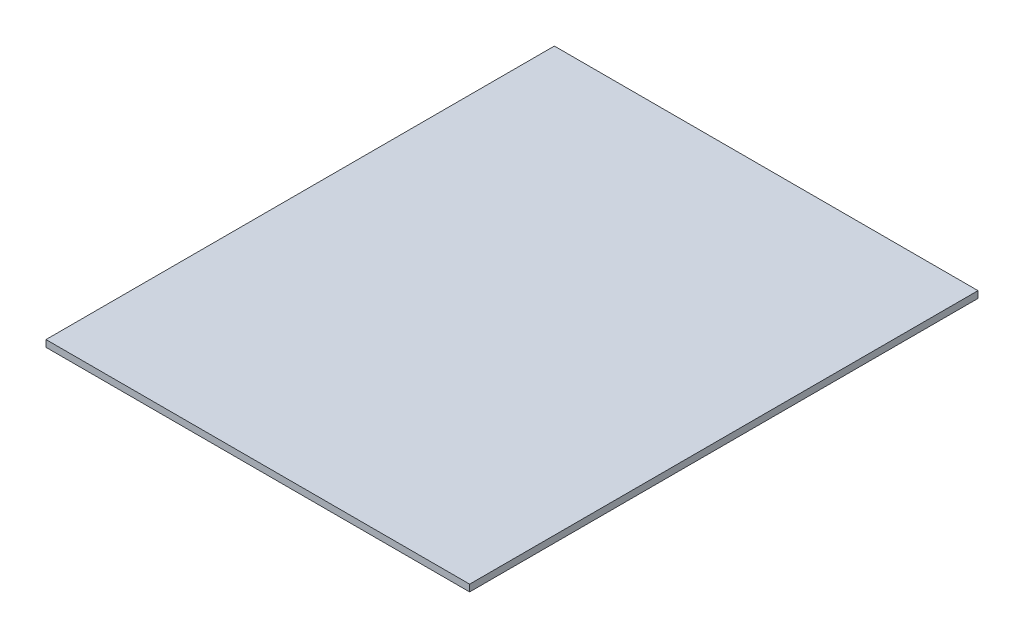
ISO-10303-21;
HEADER;
FILE_DESCRIPTION(('STEP AP214'),'2;1');
FILE_NAME('part.step','',(''),(''),'','','');
FILE_SCHEMA(('AUTOMOTIVE_DESIGN { 1 0 10303 214 1 1 1 1 }'));
ENDSEC;
DATA;
#1=APPLICATION_CONTEXT('core data for automotive mechanical design processes');
#2=APPLICATION_PROTOCOL_DEFINITION('international standard','automotive_design',2000,#1);
#3=PRODUCT_CONTEXT('',#1,'mechanical');
#4=PRODUCT('Part','Part','',(#3));
#5=PRODUCT_RELATED_PRODUCT_CATEGORY('part','',(#4));
#6=PRODUCT_DEFINITION_FORMATION('','',#4);
#7=PRODUCT_DEFINITION_CONTEXT('part definition',#1,'design');
#8=PRODUCT_DEFINITION('design','',#6,#7);
#9=PRODUCT_DEFINITION_SHAPE('','',#8);
#10=(LENGTH_UNIT() NAMED_UNIT(*) SI_UNIT(.MILLI.,.METRE.));
#11=(NAMED_UNIT(*) PLANE_ANGLE_UNIT() SI_UNIT($,.RADIAN.));
#12=(NAMED_UNIT(*) SI_UNIT($,.STERADIAN.) SOLID_ANGLE_UNIT());
#13=UNCERTAINTY_MEASURE_WITH_UNIT(LENGTH_MEASURE(1.E-05),#10,'distance_accuracy_value','');
#14=(GEOMETRIC_REPRESENTATION_CONTEXT(3) GLOBAL_UNCERTAINTY_ASSIGNED_CONTEXT((#13)) GLOBAL_UNIT_ASSIGNED_CONTEXT((#10,
#11,#12)) REPRESENTATION_CONTEXT('',''));
#15=CARTESIAN_POINT('',(0.,0.,0.));
#16=DIRECTION('',(0.,0.,1.));
#17=DIRECTION('',(1.,0.,0.));
#18=AXIS2_PLACEMENT_3D('',#15,#16,#17);
#19=CARTESIAN_POINT('',(158.75,5.08,190.5));
#20=DIRECTION('',(-1.,0.,0.));
#21=DIRECTION('',(0.,0.,1.));
#22=AXIS2_PLACEMENT_3D('',#19,#20,#21);
#23=PLANE('',#22);
#24=DIRECTION('',(0.,0.,-1.));
#25=VECTOR('',#24,1.);
#26=CARTESIAN_POINT('',(158.75,0.,190.5));
#27=LINE('',#26,#25);
#28=CARTESIAN_POINT('',(158.75,0.,190.5));
#29=VERTEX_POINT('',#28);
#30=CARTESIAN_POINT('',(158.75,0.,-190.5));
#31=VERTEX_POINT('',#30);
#32=EDGE_CURVE('E96',#29,#31,#27,.T.);
#33=ORIENTED_EDGE('',*,*,#32,.T.);
#34=DIRECTION('',(0.,-1.,0.));
#35=VECTOR('',#34,1.);
#36=CARTESIAN_POINT('',(158.75,5.08,-190.5));
#37=LINE('',#36,#35);
#38=CARTESIAN_POINT('',(158.75,5.08,-190.5));
#39=VERTEX_POINT('',#38);
#40=EDGE_CURVE('E11',#39,#31,#37,.T.);
#41=ORIENTED_EDGE('',*,*,#40,.F.);
#42=DIRECTION('',(0.,0.,-1.));
#43=VECTOR('',#42,1.);
#44=CARTESIAN_POINT('',(158.75,5.08,190.5));
#45=LINE('',#44,#43);
#46=CARTESIAN_POINT('',(158.75,5.08,190.5));
#47=VERTEX_POINT('',#46);
#48=EDGE_CURVE('E84',#47,#39,#45,.T.);
#49=ORIENTED_EDGE('',*,*,#48,.F.);
#50=DIRECTION('',(0.,-1.,0.));
#51=VECTOR('',#50,1.);
#52=CARTESIAN_POINT('',(158.75,5.08,190.5));
#53=LINE('',#52,#51);
#54=EDGE_CURVE('E92',#47,#29,#53,.T.);
#55=ORIENTED_EDGE('',*,*,#54,.T.);
#56=EDGE_LOOP('',(#33,#41,#49,#55));
#57=FACE_BOUND('',#56,.T.);
#58=ADVANCED_FACE('F33',(#57),#23,.F.);
#59=CARTESIAN_POINT('',(-158.75,5.08,-190.5));
#60=DIRECTION('',(0.,0.,1.));
#61=DIRECTION('',(1.,0.,0.));
#62=AXIS2_PLACEMENT_3D('',#59,#60,#61);
#63=PLANE('',#62);
#64=DIRECTION('',(-1.,0.,0.));
#65=VECTOR('',#64,1.);
#66=CARTESIAN_POINT('',(-158.75,0.,-190.5));
#67=LINE('',#66,#65);
#68=CARTESIAN_POINT('',(-158.75,0.,-190.5));
#69=VERTEX_POINT('',#68);
#70=EDGE_CURVE('E88',#31,#69,#67,.T.);
#71=ORIENTED_EDGE('',*,*,#70,.T.);
#72=DIRECTION('',(0.,-1.,0.));
#73=VECTOR('',#72,1.);
#74=CARTESIAN_POINT('',(-158.75,5.08,-190.5));
#75=LINE('',#74,#73);
#76=CARTESIAN_POINT('',(-158.75,5.08,-190.5));
#77=VERTEX_POINT('',#76);
#78=EDGE_CURVE('E41',#77,#69,#75,.T.);
#79=ORIENTED_EDGE('',*,*,#78,.F.);
#80=DIRECTION('',(-1.,0.,0.));
#81=VECTOR('',#80,1.);
#82=CARTESIAN_POINT('',(-158.75,5.08,-190.5));
#83=LINE('',#82,#81);
#84=EDGE_CURVE('E79',#39,#77,#83,.T.);
#85=ORIENTED_EDGE('',*,*,#84,.F.);
#86=ORIENTED_EDGE('',*,*,#40,.T.);
#87=EDGE_LOOP('',(#71,#79,#85,#86));
#88=FACE_BOUND('',#87,.T.);
#89=ADVANCED_FACE('F87',(#88),#63,.F.);
#90=CARTESIAN_POINT('',(-158.75,5.08,190.5));
#91=DIRECTION('',(1.,0.,0.));
#92=DIRECTION('',(0.,0.,-1.));
#93=AXIS2_PLACEMENT_3D('',#90,#91,#92);
#94=PLANE('',#93);
#95=DIRECTION('',(0.,0.,1.));
#96=VECTOR('',#95,1.);
#97=CARTESIAN_POINT('',(-158.75,0.,190.5));
#98=LINE('',#97,#96);
#99=CARTESIAN_POINT('',(-158.75,0.,190.5));
#100=VERTEX_POINT('',#99);
#101=EDGE_CURVE('E66',#69,#100,#98,.T.);
#102=ORIENTED_EDGE('',*,*,#101,.T.);
#103=DIRECTION('',(0.,-1.,0.));
#104=VECTOR('',#103,1.);
#105=CARTESIAN_POINT('',(-158.75,5.08,190.5));
#106=LINE('',#105,#104);
#107=CARTESIAN_POINT('',(-158.75,5.08,190.5));
#108=VERTEX_POINT('',#107);
#109=EDGE_CURVE('E89',#108,#100,#106,.T.);
#110=ORIENTED_EDGE('',*,*,#109,.F.);
#111=DIRECTION('',(0.,0.,1.));
#112=VECTOR('',#111,1.);
#113=CARTESIAN_POINT('',(-158.75,5.08,190.5));
#114=LINE('',#113,#112);
#115=EDGE_CURVE('E82',#77,#108,#114,.T.);
#116=ORIENTED_EDGE('',*,*,#115,.F.);
#117=ORIENTED_EDGE('',*,*,#78,.T.);
#118=EDGE_LOOP('',(#102,#110,#116,#117));
#119=FACE_BOUND('',#118,.T.);
#120=ADVANCED_FACE('F90',(#119),#94,.F.);
#121=CARTESIAN_POINT('',(-158.75,5.08,190.5));
#122=DIRECTION('',(0.,0.,-1.));
#123=DIRECTION('',(-1.,0.,0.));
#124=AXIS2_PLACEMENT_3D('',#121,#122,#123);
#125=PLANE('',#124);
#126=DIRECTION('',(1.,0.,0.));
#127=VECTOR('',#126,1.);
#128=CARTESIAN_POINT('',(-158.75,0.,190.5));
#129=LINE('',#128,#127);
#130=EDGE_CURVE('E72',#100,#29,#129,.T.);
#131=ORIENTED_EDGE('',*,*,#130,.T.);
#132=ORIENTED_EDGE('',*,*,#54,.F.);
#133=DIRECTION('',(1.,0.,0.));
#134=VECTOR('',#133,1.);
#135=CARTESIAN_POINT('',(-158.75,5.08,190.5));
#136=LINE('',#135,#134);
#137=EDGE_CURVE('E49',#108,#47,#136,.T.);
#138=ORIENTED_EDGE('',*,*,#137,.F.);
#139=ORIENTED_EDGE('',*,*,#109,.T.);
#140=EDGE_LOOP('',(#131,#132,#138,#139));
#141=FACE_BOUND('',#140,.T.);
#142=ADVANCED_FACE('F103',(#141),#125,.F.);
#143=CARTESIAN_POINT('',(0.,5.08,0.));
#144=DIRECTION('',(0.,-1.,0.));
#145=DIRECTION('',(0.,0.,-1.));
#146=AXIS2_PLACEMENT_3D('',#143,#144,#145);
#147=PLANE('',#146);
#148=ORIENTED_EDGE('',*,*,#48,.T.);
#149=ORIENTED_EDGE('',*,*,#84,.T.);
#150=ORIENTED_EDGE('',*,*,#115,.T.);
#151=ORIENTED_EDGE('',*,*,#137,.T.);
#152=EDGE_LOOP('',(#148,#149,#150,#151));
#153=FACE_BOUND('',#152,.T.);
#154=ADVANCED_FACE('F80',(#153),#147,.F.);
#155=CARTESIAN_POINT('',(0.,0.,0.));
#156=DIRECTION('',(0.,-1.,0.));
#157=DIRECTION('',(0.,0.,-1.));
#158=AXIS2_PLACEMENT_3D('',#155,#156,#157);
#159=PLANE('',#158);
#160=ORIENTED_EDGE('',*,*,#32,.F.);
#161=ORIENTED_EDGE('',*,*,#130,.F.);
#162=ORIENTED_EDGE('',*,*,#101,.F.);
#163=ORIENTED_EDGE('',*,*,#70,.F.);
#164=EDGE_LOOP('',(#160,#161,#162,#163));
#165=FACE_BOUND('',#164,.T.);
#166=ADVANCED_FACE('F106',(#165),#159,.T.);
#167=CLOSED_SHELL('',(#58,#89,#120,#142,#154,#166));
#168=MANIFOLD_SOLID_BREP('B2',#167);
#169=ADVANCED_BREP_SHAPE_REPRESENTATION('',(#18,#168),#14);
#170=SHAPE_DEFINITION_REPRESENTATION(#9,#169);
ENDSEC;
END-ISO-10303-21;
